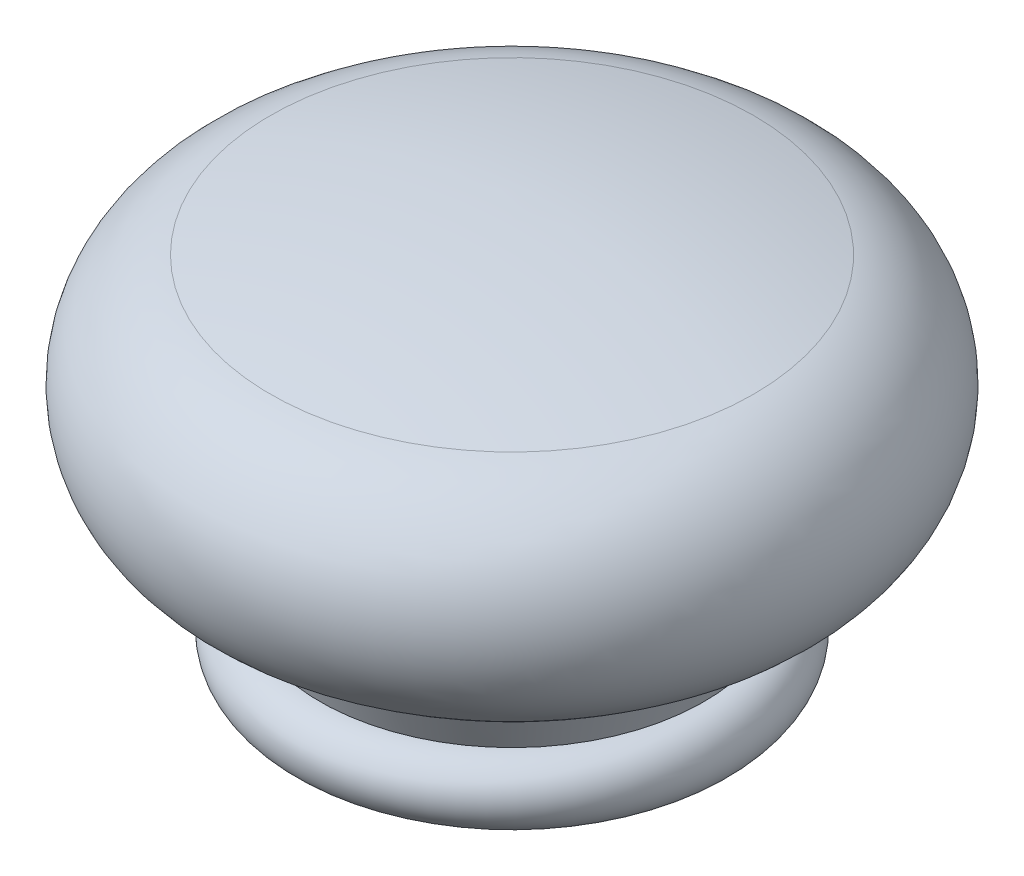
ISO-10303-21;
HEADER;
FILE_DESCRIPTION(('STEP AP214'),'2;1');
FILE_NAME('part.step','',(''),(''),'','','');
FILE_SCHEMA(('AUTOMOTIVE_DESIGN { 1 0 10303 214 1 1 1 1 }'));
ENDSEC;
DATA;
#1=APPLICATION_CONTEXT('core data for automotive mechanical design processes');
#2=APPLICATION_PROTOCOL_DEFINITION('international standard','automotive_design',2000,#1);
#3=PRODUCT_CONTEXT('',#1,'mechanical');
#4=PRODUCT('Part','Part','',(#3));
#5=PRODUCT_RELATED_PRODUCT_CATEGORY('part','',(#4));
#6=PRODUCT_DEFINITION_FORMATION('','',#4);
#7=PRODUCT_DEFINITION_CONTEXT('part definition',#1,'design');
#8=PRODUCT_DEFINITION('design','',#6,#7);
#9=PRODUCT_DEFINITION_SHAPE('','',#8);
#10=(LENGTH_UNIT() NAMED_UNIT(*) SI_UNIT(.MILLI.,.METRE.));
#11=(NAMED_UNIT(*) PLANE_ANGLE_UNIT() SI_UNIT($,.RADIAN.));
#12=(NAMED_UNIT(*) SI_UNIT($,.STERADIAN.) SOLID_ANGLE_UNIT());
#13=UNCERTAINTY_MEASURE_WITH_UNIT(LENGTH_MEASURE(1.E-05),#10,'distance_accuracy_value','');
#14=(GEOMETRIC_REPRESENTATION_CONTEXT(3) GLOBAL_UNCERTAINTY_ASSIGNED_CONTEXT((#13)) GLOBAL_UNIT_ASSIGNED_CONTEXT((#10,
#11,#12)) REPRESENTATION_CONTEXT('',''));
#15=CARTESIAN_POINT('',(0.,0.,0.));
#16=DIRECTION('',(0.,0.,1.));
#17=DIRECTION('',(1.,0.,0.));
#18=AXIS2_PLACEMENT_3D('',#15,#16,#17);
#19=CARTESIAN_POINT('',(0.,-50.,0.));
#20=DIRECTION('',(0.,-1.,0.));
#21=DIRECTION('',(1.,0.,0.));
#22=AXIS2_PLACEMENT_3D('',#19,#20,#21);
#23=SPHERICAL_SURFACE('',#22,80.);
#24=CARTESIAN_POINT('',(0.,27.7418859635398,0.));
#25=DIRECTION('',(0.,-1.,0.));
#26=DIRECTION('',(0.,0.,-1.));
#27=AXIS2_PLACEMENT_3D('',#24,#25,#26);
#28=CIRCLE('',#27,18.8732394366197);
#29=CARTESIAN_POINT('',(0.,27.7418859635398,-18.8732394366197));
#30=VERTEX_POINT('',#29);
#31=EDGE_CURVE('E60',#30,#30,#28,.T.);
#32=ORIENTED_EDGE('',*,*,#31,.F.);
#33=EDGE_LOOP('',(#32));
#34=FACE_BOUND('',#33,.T.);
#35=ADVANCED_FACE('F38',(#34),#23,.T.);
#36=CARTESIAN_POINT('',(5.,10.,0.));
#37=DIRECTION('',(0.,-1.,0.));
#38=DIRECTION('',(0.,0.,-1.));
#39=AXIS2_PLACEMENT_3D('',#36,#37,#38);
#40=PLANE('',#39);
#41=CARTESIAN_POINT('',(0.,10.,0.));
#42=DIRECTION('',(0.,-1.,0.));
#43=DIRECTION('',(0.,0.,-1.));
#44=AXIS2_PLACEMENT_3D('',#41,#42,#43);
#45=CIRCLE('',#44,5.);
#46=CARTESIAN_POINT('',(0.,10.,-5.));
#47=VERTEX_POINT('',#46);
#48=EDGE_CURVE('E12',#47,#47,#45,.T.);
#49=ORIENTED_EDGE('',*,*,#48,.T.);
#50=EDGE_LOOP('',(#49));
#51=FACE_BOUND('',#50,.T.);
#52=ADVANCED_FACE('F68',(#51),#40,.T.);
#53=CARTESIAN_POINT('',(0.,-10.1652520643637,0.));
#54=DIRECTION('',(0.,-1.,0.));
#55=DIRECTION('',(0.,0.,-1.));
#56=AXIS2_PLACEMENT_3D('',#53,#54,#55);
#57=CYLINDRICAL_SURFACE('',#56,5.);
#58=CARTESIAN_POINT('',(0.,0.,0.));
#59=DIRECTION('',(0.,-1.,0.));
#60=DIRECTION('',(0.,0.,-1.));
#61=AXIS2_PLACEMENT_3D('',#58,#59,#60);
#62=CIRCLE('',#61,5.);
#63=CARTESIAN_POINT('',(0.,0.,-5.));
#64=VERTEX_POINT('',#63);
#65=EDGE_CURVE('E44',#64,#64,#62,.T.);
#66=ORIENTED_EDGE('',*,*,#65,.T.);
#67=EDGE_LOOP('',(#66));
#68=FACE_BOUND('',#67,.T.);
#69=ORIENTED_EDGE('',*,*,#48,.F.);
#70=EDGE_LOOP('',(#69));
#71=FACE_BOUND('',#70,.T.);
#72=ADVANCED_FACE('F72',(#68,#71),#57,.F.);
#73=CARTESIAN_POINT('',(5.,0.,0.));
#74=DIRECTION('',(0.,-1.,0.));
#75=DIRECTION('',(0.,0.,-1.));
#76=AXIS2_PLACEMENT_3D('',#73,#74,#75);
#77=PLANE('',#76);
#78=CARTESIAN_POINT('',(0.,0.,0.));
#79=DIRECTION('',(0.,-1.,0.));
#80=DIRECTION('',(0.,0.,-1.));
#81=AXIS2_PLACEMENT_3D('',#78,#79,#80);
#82=CIRCLE('',#81,15.);
#83=CARTESIAN_POINT('',(0.,0.,-15.));
#84=VERTEX_POINT('',#83);
#85=EDGE_CURVE('E48',#84,#84,#82,.T.);
#86=ORIENTED_EDGE('',*,*,#85,.T.);
#87=EDGE_LOOP('',(#86));
#88=FACE_BOUND('',#87,.T.);
#89=ORIENTED_EDGE('',*,*,#65,.F.);
#90=EDGE_LOOP('',(#89));
#91=FACE_BOUND('',#90,.T.);
#92=ADVANCED_FACE('F76',(#88,#91),#77,.T.);
#93=CARTESIAN_POINT('',(0.,2.5,0.));
#94=DIRECTION('',(0.,-1.,0.));
#95=DIRECTION('',(0.,0.,-1.));
#96=AXIS2_PLACEMENT_3D('',#93,#94,#95);
#97=TOROIDAL_SURFACE('',#96,15.,2.5);
#98=CARTESIAN_POINT('',(0.,5.,0.));
#99=DIRECTION('',(0.,-1.,0.));
#100=DIRECTION('',(0.,0.,-1.));
#101=AXIS2_PLACEMENT_3D('',#98,#99,#100);
#102=CIRCLE('',#101,15.);
#103=CARTESIAN_POINT('',(0.,5.,-15.));
#104=VERTEX_POINT('',#103);
#105=EDGE_CURVE('E52',#104,#104,#102,.T.);
#106=ORIENTED_EDGE('',*,*,#105,.T.);
#107=EDGE_LOOP('',(#106));
#108=FACE_BOUND('',#107,.T.);
#109=ORIENTED_EDGE('',*,*,#85,.F.);
#110=EDGE_LOOP('',(#109));
#111=FACE_BOUND('',#110,.T.);
#112=ADVANCED_FACE('F81',(#108,#111),#97,.T.);
#113=CARTESIAN_POINT('',(0.,5.,0.));
#114=DIRECTION('',(0.,1.,0.));
#115=DIRECTION('',(0.,0.,1.));
#116=AXIS2_PLACEMENT_3D('',#113,#114,#115);
#117=CONICAL_SURFACE('',#116,15.,0.380547989377512);
#118=CARTESIAN_POINT('',(0.,9.99939668491825,0.));
#119=DIRECTION('',(0.,-1.,0.));
#120=DIRECTION('',(0.,0.,-1.));
#121=AXIS2_PLACEMENT_3D('',#118,#119,#120);
#122=CIRCLE('',#121,17.);
#123=CARTESIAN_POINT('',(0.,9.99939668491825,-17.));
#124=VERTEX_POINT('',#123);
#125=EDGE_CURVE('E57',#124,#124,#122,.T.);
#126=ORIENTED_EDGE('',*,*,#125,.T.);
#127=EDGE_LOOP('',(#126));
#128=FACE_BOUND('',#127,.T.);
#129=ORIENTED_EDGE('',*,*,#105,.F.);
#130=EDGE_LOOP('',(#129));
#131=FACE_BOUND('',#130,.T.);
#132=ADVANCED_FACE('F85',(#128,#131),#117,.T.);
#133=CARTESIAN_POINT('',(0.,18.9959237926415,0.));
#134=DIRECTION('',(0.,-1.,0.));
#135=DIRECTION('',(0.,0.,-1.));
#136=AXIS2_PLACEMENT_3D('',#133,#134,#135);
#137=TOROIDAL_SURFACE('',#136,16.75,9.);
#138=ORIENTED_EDGE('',*,*,#31,.T.);
#139=EDGE_LOOP('',(#138));
#140=FACE_BOUND('',#139,.T.);
#141=ORIENTED_EDGE('',*,*,#125,.F.);
#142=EDGE_LOOP('',(#141));
#143=FACE_BOUND('',#142,.T.);
#144=ADVANCED_FACE('F64',(#140,#143),#137,.T.);
#145=CLOSED_SHELL('',(#35,#52,#72,#92,#112,#132,#144));
#146=MANIFOLD_SOLID_BREP('B2',#145);
#147=ADVANCED_BREP_SHAPE_REPRESENTATION('',(#18,#146),#14);
#148=SHAPE_DEFINITION_REPRESENTATION(#9,#147);
ENDSEC;
END-ISO-10303-21;
